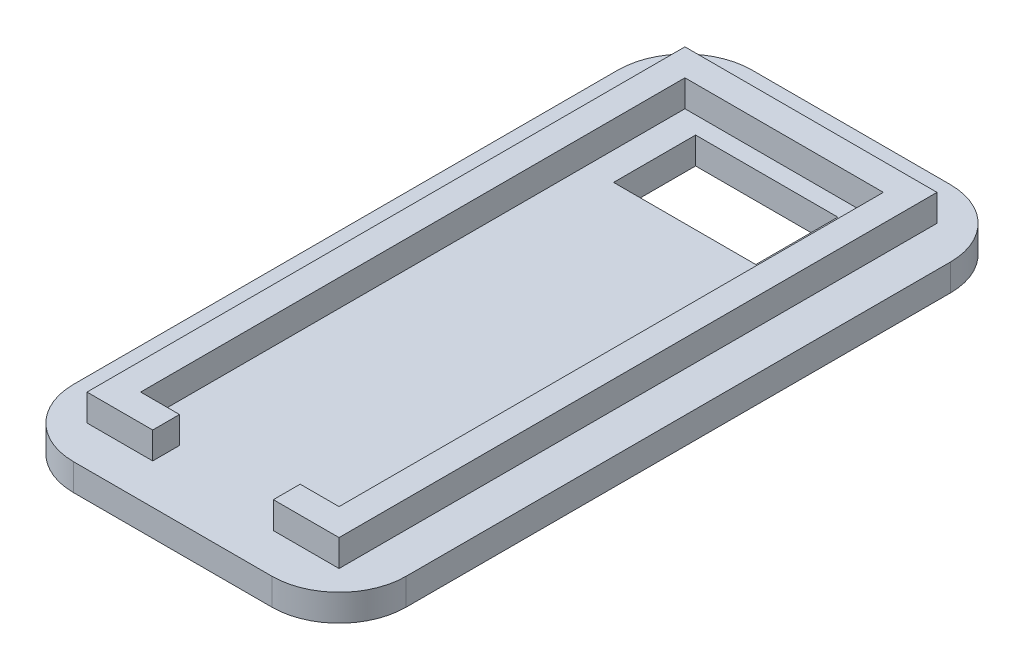
ISO-10303-21;
HEADER;
FILE_DESCRIPTION(('STEP AP214'),'2;1');
FILE_NAME('part.step','',(''),(''),'','','');
FILE_SCHEMA(('AUTOMOTIVE_DESIGN { 1 0 10303 214 1 1 1 1 }'));
ENDSEC;
DATA;
#1=APPLICATION_CONTEXT('core data for automotive mechanical design processes');
#2=APPLICATION_PROTOCOL_DEFINITION('international standard','automotive_design',2000,#1);
#3=PRODUCT_CONTEXT('',#1,'mechanical');
#4=PRODUCT('Part','Part','',(#3));
#5=PRODUCT_RELATED_PRODUCT_CATEGORY('part','',(#4));
#6=PRODUCT_DEFINITION_FORMATION('','',#4);
#7=PRODUCT_DEFINITION_CONTEXT('part definition',#1,'design');
#8=PRODUCT_DEFINITION('design','',#6,#7);
#9=PRODUCT_DEFINITION_SHAPE('','',#8);
#10=(LENGTH_UNIT() NAMED_UNIT(*) SI_UNIT(.MILLI.,.METRE.));
#11=(NAMED_UNIT(*) PLANE_ANGLE_UNIT() SI_UNIT($,.RADIAN.));
#12=(NAMED_UNIT(*) SI_UNIT($,.STERADIAN.) SOLID_ANGLE_UNIT());
#13=UNCERTAINTY_MEASURE_WITH_UNIT(LENGTH_MEASURE(1.E-05),#10,'distance_accuracy_value','');
#14=(GEOMETRIC_REPRESENTATION_CONTEXT(3) GLOBAL_UNCERTAINTY_ASSIGNED_CONTEXT((#13)) GLOBAL_UNIT_ASSIGNED_CONTEXT((#10,
#11,#12)) REPRESENTATION_CONTEXT('',''));
#15=CARTESIAN_POINT('',(0.,0.,0.));
#16=DIRECTION('',(0.,0.,1.));
#17=DIRECTION('',(1.,0.,0.));
#18=AXIS2_PLACEMENT_3D('',#15,#16,#17);
#19=CARTESIAN_POINT('',(0.,2.,0.));
#20=DIRECTION('',(0.,-1.,0.));
#21=DIRECTION('',(0.,0.,-1.));
#22=AXIS2_PLACEMENT_3D('',#19,#20,#21);
#23=PLANE('',#22);
#24=DIRECTION('',(0.,0.,1.));
#25=VECTOR('',#24,1.);
#26=CARTESIAN_POINT('',(-12.4,2.,-25.3));
#27=LINE('',#26,#25);
#28=CARTESIAN_POINT('',(-12.4,2.,-20.3));
#29=VERTEX_POINT('',#28);
#30=CARTESIAN_POINT('',(-12.4,2.,20.3));
#31=VERTEX_POINT('',#30);
#32=EDGE_CURVE('E326',#29,#31,#27,.T.);
#33=ORIENTED_EDGE('',*,*,#32,.T.);
#34=CARTESIAN_POINT('',(-7.4,2.,20.3));
#35=DIRECTION('',(0.,-1.,0.));
#36=DIRECTION('',(0.,0.,-1.));
#37=AXIS2_PLACEMENT_3D('',#34,#35,#36);
#38=CIRCLE('',#37,5.);
#39=CARTESIAN_POINT('',(-7.4,2.,25.3));
#40=VERTEX_POINT('',#39);
#41=EDGE_CURVE('E366',#31,#40,#38,.F.);
#42=ORIENTED_EDGE('',*,*,#41,.T.);
#43=DIRECTION('',(1.,0.,0.));
#44=VECTOR('',#43,1.);
#45=CARTESIAN_POINT('',(-12.4,2.,25.3));
#46=LINE('',#45,#44);
#47=CARTESIAN_POINT('',(7.4,2.,25.3));
#48=VERTEX_POINT('',#47);
#49=EDGE_CURVE('E330',#40,#48,#46,.T.);
#50=ORIENTED_EDGE('',*,*,#49,.T.);
#51=CARTESIAN_POINT('',(7.4,2.,20.3));
#52=DIRECTION('',(0.,-1.,0.));
#53=DIRECTION('',(0.,0.,-1.));
#54=AXIS2_PLACEMENT_3D('',#51,#52,#53);
#55=CIRCLE('',#54,5.);
#56=CARTESIAN_POINT('',(12.4,2.,20.3));
#57=VERTEX_POINT('',#56);
#58=EDGE_CURVE('E56',#48,#57,#55,.F.);
#59=ORIENTED_EDGE('',*,*,#58,.T.);
#60=DIRECTION('',(0.,0.,-1.));
#61=VECTOR('',#60,1.);
#62=CARTESIAN_POINT('',(12.4,2.,-25.3));
#63=LINE('',#62,#61);
#64=CARTESIAN_POINT('',(12.4,2.,-20.3));
#65=VERTEX_POINT('',#64);
#66=EDGE_CURVE('E332',#57,#65,#63,.T.);
#67=ORIENTED_EDGE('',*,*,#66,.T.);
#68=CARTESIAN_POINT('',(7.39999999999999,2.,-20.3));
#69=DIRECTION('',(0.,-1.,0.));
#70=DIRECTION('',(0.,0.,-1.));
#71=AXIS2_PLACEMENT_3D('',#68,#69,#70);
#72=CIRCLE('',#71,5.);
#73=CARTESIAN_POINT('',(7.39999999999999,2.,-25.3));
#74=VERTEX_POINT('',#73);
#75=EDGE_CURVE('E363',#65,#74,#72,.F.);
#76=ORIENTED_EDGE('',*,*,#75,.T.);
#77=DIRECTION('',(-1.,0.,0.));
#78=VECTOR('',#77,1.);
#79=CARTESIAN_POINT('',(-12.4,2.,-25.3));
#80=LINE('',#79,#78);
#81=CARTESIAN_POINT('',(-7.4,2.,-25.3));
#82=VERTEX_POINT('',#81);
#83=EDGE_CURVE('E323',#74,#82,#80,.T.);
#84=ORIENTED_EDGE('',*,*,#83,.T.);
#85=CARTESIAN_POINT('',(-7.4,2.,-20.3));
#86=DIRECTION('',(0.,-1.,0.));
#87=DIRECTION('',(0.,0.,-1.));
#88=AXIS2_PLACEMENT_3D('',#85,#86,#87);
#89=CIRCLE('',#88,5.);
#90=EDGE_CURVE('E361',#82,#29,#89,.F.);
#91=ORIENTED_EDGE('',*,*,#90,.T.);
#92=EDGE_LOOP('',(#33,#42,#50,#59,#67,#76,#84,#91));
#93=FACE_BOUND('',#92,.T.);
#94=DIRECTION('',(0.,0.,1.));
#95=VECTOR('',#94,1.);
#96=CARTESIAN_POINT('',(4.5,2.,0.));
#97=LINE('',#96,#95);
#98=CARTESIAN_POINT('',(4.5,2.,20.3));
#99=VERTEX_POINT('',#98);
#100=CARTESIAN_POINT('',(4.5,2.,22.3));
#101=VERTEX_POINT('',#100);
#102=EDGE_CURVE('E270',#99,#101,#97,.T.);
#103=ORIENTED_EDGE('',*,*,#102,.F.);
#104=DIRECTION('',(1.,0.,0.));
#105=VECTOR('',#104,1.);
#106=CARTESIAN_POINT('',(0.,2.,20.3));
#107=LINE('',#106,#105);
#108=CARTESIAN_POINT('',(7.4,2.,20.3));
#109=VERTEX_POINT('',#108);
#110=EDGE_CURVE('E216',#99,#109,#107,.T.);
#111=ORIENTED_EDGE('',*,*,#110,.T.);
#112=DIRECTION('',(0.,0.,-1.));
#113=VECTOR('',#112,1.);
#114=CARTESIAN_POINT('',(7.4,2.,0.));
#115=LINE('',#114,#113);
#116=CARTESIAN_POINT('',(7.4,2.,-20.3));
#117=VERTEX_POINT('',#116);
#118=EDGE_CURVE('E243',#109,#117,#115,.T.);
#119=ORIENTED_EDGE('',*,*,#118,.T.);
#120=DIRECTION('',(-1.,0.,0.));
#121=VECTOR('',#120,1.);
#122=CARTESIAN_POINT('',(0.,2.,-20.3));
#123=LINE('',#122,#121);
#124=CARTESIAN_POINT('',(-7.39999999999999,2.,-20.3));
#125=VERTEX_POINT('',#124);
#126=EDGE_CURVE('E288',#117,#125,#123,.T.);
#127=ORIENTED_EDGE('',*,*,#126,.T.);
#128=DIRECTION('',(0.,0.,1.));
#129=VECTOR('',#128,1.);
#130=CARTESIAN_POINT('',(-7.39999999999999,2.,0.));
#131=LINE('',#130,#129);
#132=CARTESIAN_POINT('',(-7.39999999999999,2.,20.3));
#133=VERTEX_POINT('',#132);
#134=EDGE_CURVE('E285',#125,#133,#131,.T.);
#135=ORIENTED_EDGE('',*,*,#134,.T.);
#136=CARTESIAN_POINT('',(-4.5,2.,20.3));
#137=VERTEX_POINT('',#136);
#138=EDGE_CURVE('E271',#133,#137,#107,.T.);
#139=ORIENTED_EDGE('',*,*,#138,.T.);
#140=DIRECTION('',(0.,0.,1.));
#141=VECTOR('',#140,1.);
#142=CARTESIAN_POINT('',(-4.5,2.,0.));
#143=LINE('',#142,#141);
#144=CARTESIAN_POINT('',(-4.5,2.,22.3));
#145=VERTEX_POINT('',#144);
#146=EDGE_CURVE('E282',#137,#145,#143,.T.);
#147=ORIENTED_EDGE('',*,*,#146,.T.);
#148=DIRECTION('',(1.,0.,0.));
#149=VECTOR('',#148,1.);
#150=CARTESIAN_POINT('',(0.,2.,22.3));
#151=LINE('',#150,#149);
#152=CARTESIAN_POINT('',(-9.4,2.,22.3));
#153=VERTEX_POINT('',#152);
#154=EDGE_CURVE('E276',#153,#145,#151,.T.);
#155=ORIENTED_EDGE('',*,*,#154,.F.);
#156=DIRECTION('',(0.,0.,1.));
#157=VECTOR('',#156,1.);
#158=CARTESIAN_POINT('',(-9.4,2.,0.));
#159=LINE('',#158,#157);
#160=CARTESIAN_POINT('',(-9.4,2.,-22.3));
#161=VERTEX_POINT('',#160);
#162=EDGE_CURVE('E280',#161,#153,#159,.T.);
#163=ORIENTED_EDGE('',*,*,#162,.F.);
#164=DIRECTION('',(-1.,0.,0.));
#165=VECTOR('',#164,1.);
#166=CARTESIAN_POINT('',(0.,2.,-22.3));
#167=LINE('',#166,#165);
#168=CARTESIAN_POINT('',(9.4,2.,-22.3));
#169=VERTEX_POINT('',#168);
#170=EDGE_CURVE('E278',#169,#161,#167,.T.);
#171=ORIENTED_EDGE('',*,*,#170,.F.);
#172=DIRECTION('',(0.,0.,-1.));
#173=VECTOR('',#172,1.);
#174=CARTESIAN_POINT('',(9.4,2.,0.));
#175=LINE('',#174,#173);
#176=CARTESIAN_POINT('',(9.4,2.,22.3));
#177=VERTEX_POINT('',#176);
#178=EDGE_CURVE('E275',#177,#169,#175,.T.);
#179=ORIENTED_EDGE('',*,*,#178,.F.);
#180=EDGE_CURVE('E273',#101,#177,#151,.T.);
#181=ORIENTED_EDGE('',*,*,#180,.F.);
#182=EDGE_LOOP('',(#103,#111,#119,#127,#135,#139,#147,#155,#163,#171,#179,#181));
#183=FACE_BOUND('',#182,.T.);
#184=DIRECTION('',(1.,0.,0.));
#185=VECTOR('',#184,1.);
#186=CARTESIAN_POINT('',(-5.30499999999999,2.,-19.));
#187=LINE('',#186,#185);
#188=CARTESIAN_POINT('',(-5.30499999999999,2.,-19.));
#189=VERTEX_POINT('',#188);
#190=CARTESIAN_POINT('',(5.30500000000001,2.,-19.));
#191=VERTEX_POINT('',#190);
#192=EDGE_CURVE('E227',#189,#191,#187,.T.);
#193=ORIENTED_EDGE('',*,*,#192,.T.);
#194=DIRECTION('',(0.,0.,1.));
#195=VECTOR('',#194,1.);
#196=CARTESIAN_POINT('',(5.30500000000001,2.,-19.));
#197=LINE('',#196,#195);
#198=CARTESIAN_POINT('',(5.30500000000001,2.,-12.88));
#199=VERTEX_POINT('',#198);
#200=EDGE_CURVE('E215',#191,#199,#197,.T.);
#201=ORIENTED_EDGE('',*,*,#200,.T.);
#202=DIRECTION('',(1.,0.,0.));
#203=VECTOR('',#202,1.);
#204=CARTESIAN_POINT('',(-5.30499999999999,2.,-12.88));
#205=LINE('',#204,#203);
#206=CARTESIAN_POINT('',(-5.30499999999999,2.,-12.88));
#207=VERTEX_POINT('',#206);
#208=EDGE_CURVE('E230',#207,#199,#205,.T.);
#209=ORIENTED_EDGE('',*,*,#208,.F.);
#210=DIRECTION('',(0.,0.,1.));
#211=VECTOR('',#210,1.);
#212=CARTESIAN_POINT('',(-5.30499999999999,2.,-19.));
#213=LINE('',#212,#211);
#214=EDGE_CURVE('E209',#189,#207,#213,.T.);
#215=ORIENTED_EDGE('',*,*,#214,.F.);
#216=EDGE_LOOP('',(#193,#201,#209,#215));
#217=FACE_BOUND('',#216,.T.);
#218=ADVANCED_FACE('F34',(#93,#183,#217),#23,.F.);
#219=CARTESIAN_POINT('',(0.,0.,0.));
#220=DIRECTION('',(0.,-1.,0.));
#221=DIRECTION('',(0.,0.,-1.));
#222=AXIS2_PLACEMENT_3D('',#219,#220,#221);
#223=PLANE('',#222);
#224=DIRECTION('',(1.,0.,0.));
#225=VECTOR('',#224,1.);
#226=CARTESIAN_POINT('',(-12.4,0.,25.3));
#227=LINE('',#226,#225);
#228=CARTESIAN_POINT('',(-7.4,0.,25.3));
#229=VERTEX_POINT('',#228);
#230=CARTESIAN_POINT('',(7.4,0.,25.3));
#231=VERTEX_POINT('',#230);
#232=EDGE_CURVE('E340',#229,#231,#227,.T.);
#233=ORIENTED_EDGE('',*,*,#232,.F.);
#234=CARTESIAN_POINT('',(-7.4,0.,20.3));
#235=DIRECTION('',(0.,-1.,0.));
#236=DIRECTION('',(0.,0.,-1.));
#237=AXIS2_PLACEMENT_3D('',#234,#235,#236);
#238=CIRCLE('',#237,5.);
#239=CARTESIAN_POINT('',(-12.4,0.,20.3));
#240=VERTEX_POINT('',#239);
#241=EDGE_CURVE('E354',#229,#240,#238,.T.);
#242=ORIENTED_EDGE('',*,*,#241,.T.);
#243=DIRECTION('',(0.,0.,1.));
#244=VECTOR('',#243,1.);
#245=CARTESIAN_POINT('',(-12.4,0.,-25.3));
#246=LINE('',#245,#244);
#247=CARTESIAN_POINT('',(-12.4,0.,-20.3));
#248=VERTEX_POINT('',#247);
#249=EDGE_CURVE('E337',#248,#240,#246,.T.);
#250=ORIENTED_EDGE('',*,*,#249,.F.);
#251=CARTESIAN_POINT('',(-7.4,0.,-20.3));
#252=DIRECTION('',(0.,-1.,0.));
#253=DIRECTION('',(0.,0.,-1.));
#254=AXIS2_PLACEMENT_3D('',#251,#252,#253);
#255=CIRCLE('',#254,5.);
#256=CARTESIAN_POINT('',(-7.4,0.,-25.3));
#257=VERTEX_POINT('',#256);
#258=EDGE_CURVE('E348',#248,#257,#255,.T.);
#259=ORIENTED_EDGE('',*,*,#258,.T.);
#260=DIRECTION('',(-1.,0.,0.));
#261=VECTOR('',#260,1.);
#262=CARTESIAN_POINT('',(-12.4,0.,-25.3));
#263=LINE('',#262,#261);
#264=CARTESIAN_POINT('',(7.39999999999999,0.,-25.3));
#265=VERTEX_POINT('',#264);
#266=EDGE_CURVE('E322',#265,#257,#263,.T.);
#267=ORIENTED_EDGE('',*,*,#266,.F.);
#268=CARTESIAN_POINT('',(7.39999999999999,0.,-20.3));
#269=DIRECTION('',(0.,-1.,0.));
#270=DIRECTION('',(0.,0.,-1.));
#271=AXIS2_PLACEMENT_3D('',#268,#269,#270);
#272=CIRCLE('',#271,5.);
#273=CARTESIAN_POINT('',(12.4,0.,-20.3));
#274=VERTEX_POINT('',#273);
#275=EDGE_CURVE('E350',#265,#274,#272,.T.);
#276=ORIENTED_EDGE('',*,*,#275,.T.);
#277=DIRECTION('',(0.,0.,-1.));
#278=VECTOR('',#277,1.);
#279=CARTESIAN_POINT('',(12.4,0.,-25.3));
#280=LINE('',#279,#278);
#281=CARTESIAN_POINT('',(12.4,0.,20.3));
#282=VERTEX_POINT('',#281);
#283=EDGE_CURVE('E327',#282,#274,#280,.T.);
#284=ORIENTED_EDGE('',*,*,#283,.F.);
#285=CARTESIAN_POINT('',(7.4,0.,20.3));
#286=DIRECTION('',(0.,-1.,0.));
#287=DIRECTION('',(0.,0.,-1.));
#288=AXIS2_PLACEMENT_3D('',#285,#286,#287);
#289=CIRCLE('',#288,5.);
#290=EDGE_CURVE('E352',#282,#231,#289,.T.);
#291=ORIENTED_EDGE('',*,*,#290,.T.);
#292=EDGE_LOOP('',(#233,#242,#250,#259,#267,#276,#284,#291));
#293=FACE_BOUND('',#292,.T.);
#294=DIRECTION('',(0.,0.,1.));
#295=VECTOR('',#294,1.);
#296=CARTESIAN_POINT('',(5.30500000000001,0.,-19.));
#297=LINE('',#296,#295);
#298=CARTESIAN_POINT('',(5.30500000000001,0.,-19.));
#299=VERTEX_POINT('',#298);
#300=CARTESIAN_POINT('',(5.30500000000001,0.,-12.88));
#301=VERTEX_POINT('',#300);
#302=EDGE_CURVE('E208',#299,#301,#297,.T.);
#303=ORIENTED_EDGE('',*,*,#302,.F.);
#304=DIRECTION('',(1.,0.,0.));
#305=VECTOR('',#304,1.);
#306=CARTESIAN_POINT('',(-5.30499999999999,0.,-19.));
#307=LINE('',#306,#305);
#308=CARTESIAN_POINT('',(-5.30499999999999,0.,-19.));
#309=VERTEX_POINT('',#308);
#310=EDGE_CURVE('E197',#309,#299,#307,.T.);
#311=ORIENTED_EDGE('',*,*,#310,.F.);
#312=DIRECTION('',(0.,0.,1.));
#313=VECTOR('',#312,1.);
#314=CARTESIAN_POINT('',(-5.30499999999999,0.,-19.));
#315=LINE('',#314,#313);
#316=CARTESIAN_POINT('',(-5.30499999999999,0.,-12.88));
#317=VERTEX_POINT('',#316);
#318=EDGE_CURVE('E223',#309,#317,#315,.T.);
#319=ORIENTED_EDGE('',*,*,#318,.T.);
#320=DIRECTION('',(1.,0.,0.));
#321=VECTOR('',#320,1.);
#322=CARTESIAN_POINT('',(-5.30499999999999,0.,-12.88));
#323=LINE('',#322,#321);
#324=EDGE_CURVE('E221',#317,#301,#323,.T.);
#325=ORIENTED_EDGE('',*,*,#324,.T.);
#326=EDGE_LOOP('',(#303,#311,#319,#325));
#327=FACE_BOUND('',#326,.T.);
#328=ADVANCED_FACE('F220',(#293,#327),#223,.T.);
#329=CARTESIAN_POINT('',(-12.4,2.,-25.3));
#330=DIRECTION('',(0.,0.,1.));
#331=DIRECTION('',(1.,0.,0.));
#332=AXIS2_PLACEMENT_3D('',#329,#330,#331);
#333=PLANE('',#332);
#334=ORIENTED_EDGE('',*,*,#83,.F.);
#335=DIRECTION('',(0.,-1.,0.));
#336=VECTOR('',#335,1.);
#337=CARTESIAN_POINT('',(7.39999999999999,2.,-25.3));
#338=LINE('',#337,#336);
#339=EDGE_CURVE('E11',#74,#265,#338,.T.);
#340=ORIENTED_EDGE('',*,*,#339,.T.);
#341=ORIENTED_EDGE('',*,*,#266,.T.);
#342=DIRECTION('',(0.,-1.,0.));
#343=VECTOR('',#342,1.);
#344=CARTESIAN_POINT('',(-7.4,2.,-25.3));
#345=LINE('',#344,#343);
#346=EDGE_CURVE('E42',#257,#82,#345,.F.);
#347=ORIENTED_EDGE('',*,*,#346,.T.);
#348=EDGE_LOOP('',(#334,#340,#341,#347));
#349=FACE_BOUND('',#348,.T.);
#350=ADVANCED_FACE('F374',(#349),#333,.F.);
#351=CARTESIAN_POINT('',(-12.4,2.,-25.3));
#352=DIRECTION('',(1.,0.,0.));
#353=DIRECTION('',(0.,0.,-1.));
#354=AXIS2_PLACEMENT_3D('',#351,#352,#353);
#355=PLANE('',#354);
#356=ORIENTED_EDGE('',*,*,#249,.T.);
#357=DIRECTION('',(0.,-1.,0.));
#358=VECTOR('',#357,1.);
#359=CARTESIAN_POINT('',(-12.4,2.,20.3));
#360=LINE('',#359,#358);
#361=EDGE_CURVE('E359',#240,#31,#360,.F.);
#362=ORIENTED_EDGE('',*,*,#361,.T.);
#363=ORIENTED_EDGE('',*,*,#32,.F.);
#364=DIRECTION('',(0.,-1.,0.));
#365=VECTOR('',#364,1.);
#366=CARTESIAN_POINT('',(-12.4,2.,-20.3));
#367=LINE('',#366,#365);
#368=EDGE_CURVE('E356',#29,#248,#367,.T.);
#369=ORIENTED_EDGE('',*,*,#368,.T.);
#370=EDGE_LOOP('',(#356,#362,#363,#369));
#371=FACE_BOUND('',#370,.T.);
#372=ADVANCED_FACE('F385',(#371),#355,.F.);
#373=CARTESIAN_POINT('',(-12.4,2.,25.3));
#374=DIRECTION('',(0.,0.,-1.));
#375=DIRECTION('',(-1.,0.,0.));
#376=AXIS2_PLACEMENT_3D('',#373,#374,#375);
#377=PLANE('',#376);
#378=ORIENTED_EDGE('',*,*,#49,.F.);
#379=DIRECTION('',(0.,-1.,0.));
#380=VECTOR('',#379,1.);
#381=CARTESIAN_POINT('',(-7.4,2.,25.3));
#382=LINE('',#381,#380);
#383=EDGE_CURVE('E345',#40,#229,#382,.T.);
#384=ORIENTED_EDGE('',*,*,#383,.T.);
#385=ORIENTED_EDGE('',*,*,#232,.T.);
#386=DIRECTION('',(0.,-1.,0.));
#387=VECTOR('',#386,1.);
#388=CARTESIAN_POINT('',(7.4,2.,25.3));
#389=LINE('',#388,#387);
#390=EDGE_CURVE('E334',#231,#48,#389,.F.);
#391=ORIENTED_EDGE('',*,*,#390,.T.);
#392=EDGE_LOOP('',(#378,#384,#385,#391));
#393=FACE_BOUND('',#392,.T.);
#394=ADVANCED_FACE('F395',(#393),#377,.F.);
#395=CARTESIAN_POINT('',(12.4,2.,-25.3));
#396=DIRECTION('',(-1.,0.,0.));
#397=DIRECTION('',(0.,0.,1.));
#398=AXIS2_PLACEMENT_3D('',#395,#396,#397);
#399=PLANE('',#398);
#400=ORIENTED_EDGE('',*,*,#66,.F.);
#401=DIRECTION('',(0.,-1.,0.));
#402=VECTOR('',#401,1.);
#403=CARTESIAN_POINT('',(12.4,2.,20.3));
#404=LINE('',#403,#402);
#405=EDGE_CURVE('E369',#57,#282,#404,.T.);
#406=ORIENTED_EDGE('',*,*,#405,.T.);
#407=ORIENTED_EDGE('',*,*,#283,.T.);
#408=DIRECTION('',(0.,-1.,0.));
#409=VECTOR('',#408,1.);
#410=CARTESIAN_POINT('',(12.4,2.,-20.3));
#411=LINE('',#410,#409);
#412=EDGE_CURVE('E49',#274,#65,#411,.F.);
#413=ORIENTED_EDGE('',*,*,#412,.T.);
#414=EDGE_LOOP('',(#400,#406,#407,#413));
#415=FACE_BOUND('',#414,.T.);
#416=ADVANCED_FACE('F401',(#415),#399,.F.);
#417=CARTESIAN_POINT('',(0.,4.,20.3));
#418=DIRECTION('',(0.,0.,-1.));
#419=DIRECTION('',(-1.,0.,0.));
#420=AXIS2_PLACEMENT_3D('',#417,#418,#419);
#421=PLANE('',#420);
#422=ORIENTED_EDGE('',*,*,#110,.F.);
#423=DIRECTION('',(0.,-1.,0.));
#424=VECTOR('',#423,1.);
#425=CARTESIAN_POINT('',(4.5,4.,20.3));
#426=LINE('',#425,#424);
#427=CARTESIAN_POINT('',(4.5,4.,20.3));
#428=VERTEX_POINT('',#427);
#429=EDGE_CURVE('E320',#428,#99,#426,.T.);
#430=ORIENTED_EDGE('',*,*,#429,.F.);
#431=DIRECTION('',(1.,0.,0.));
#432=VECTOR('',#431,1.);
#433=CARTESIAN_POINT('',(0.,4.,20.3));
#434=LINE('',#433,#432);
#435=CARTESIAN_POINT('',(7.4,4.,20.3));
#436=VERTEX_POINT('',#435);
#437=EDGE_CURVE('E239',#428,#436,#434,.T.);
#438=ORIENTED_EDGE('',*,*,#437,.T.);
#439=DIRECTION('',(0.,-1.,0.));
#440=VECTOR('',#439,1.);
#441=CARTESIAN_POINT('',(7.4,4.,20.3));
#442=LINE('',#441,#440);
#443=EDGE_CURVE('E267',#436,#109,#442,.T.);
#444=ORIENTED_EDGE('',*,*,#443,.T.);
#445=EDGE_LOOP('',(#422,#430,#438,#444));
#446=FACE_BOUND('',#445,.T.);
#447=ADVANCED_FACE('F422',(#446),#421,.T.);
#448=CARTESIAN_POINT('',(4.5,4.,0.));
#449=DIRECTION('',(1.,0.,0.));
#450=DIRECTION('',(0.,0.,-1.));
#451=AXIS2_PLACEMENT_3D('',#448,#449,#450);
#452=PLANE('',#451);
#453=ORIENTED_EDGE('',*,*,#102,.T.);
#454=DIRECTION('',(0.,-1.,0.));
#455=VECTOR('',#454,1.);
#456=CARTESIAN_POINT('',(4.5,4.,22.3));
#457=LINE('',#456,#455);
#458=CARTESIAN_POINT('',(4.5,4.,22.3));
#459=VERTEX_POINT('',#458);
#460=EDGE_CURVE('E317',#459,#101,#457,.T.);
#461=ORIENTED_EDGE('',*,*,#460,.F.);
#462=DIRECTION('',(0.,0.,1.));
#463=VECTOR('',#462,1.);
#464=CARTESIAN_POINT('',(4.5,4.,0.));
#465=LINE('',#464,#463);
#466=EDGE_CURVE('E242',#428,#459,#465,.T.);
#467=ORIENTED_EDGE('',*,*,#466,.F.);
#468=ORIENTED_EDGE('',*,*,#429,.T.);
#469=EDGE_LOOP('',(#453,#461,#467,#468));
#470=FACE_BOUND('',#469,.T.);
#471=ADVANCED_FACE('F417',(#470),#452,.F.);
#472=CARTESIAN_POINT('',(0.,4.,22.3));
#473=DIRECTION('',(0.,0.,-1.));
#474=DIRECTION('',(-1.,0.,0.));
#475=AXIS2_PLACEMENT_3D('',#472,#473,#474);
#476=PLANE('',#475);
#477=ORIENTED_EDGE('',*,*,#180,.T.);
#478=DIRECTION('',(0.,-1.,0.));
#479=VECTOR('',#478,1.);
#480=CARTESIAN_POINT('',(9.4,4.,22.3));
#481=LINE('',#480,#479);
#482=CARTESIAN_POINT('',(9.4,4.,22.3));
#483=VERTEX_POINT('',#482);
#484=EDGE_CURVE('E314',#483,#177,#481,.T.);
#485=ORIENTED_EDGE('',*,*,#484,.F.);
#486=DIRECTION('',(1.,0.,0.));
#487=VECTOR('',#486,1.);
#488=CARTESIAN_POINT('',(0.,4.,22.3));
#489=LINE('',#488,#487);
#490=EDGE_CURVE('E246',#459,#483,#489,.T.);
#491=ORIENTED_EDGE('',*,*,#490,.F.);
#492=ORIENTED_EDGE('',*,*,#460,.T.);
#493=EDGE_LOOP('',(#477,#485,#491,#492));
#494=FACE_BOUND('',#493,.T.);
#495=ADVANCED_FACE('F476',(#494),#476,.F.);
#496=CARTESIAN_POINT('',(9.4,4.,0.));
#497=DIRECTION('',(-1.,0.,0.));
#498=DIRECTION('',(0.,0.,1.));
#499=AXIS2_PLACEMENT_3D('',#496,#497,#498);
#500=PLANE('',#499);
#501=ORIENTED_EDGE('',*,*,#178,.T.);
#502=DIRECTION('',(0.,-1.,0.));
#503=VECTOR('',#502,1.);
#504=CARTESIAN_POINT('',(9.4,4.,-22.3));
#505=LINE('',#504,#503);
#506=CARTESIAN_POINT('',(9.4,4.,-22.3));
#507=VERTEX_POINT('',#506);
#508=EDGE_CURVE('E311',#507,#169,#505,.T.);
#509=ORIENTED_EDGE('',*,*,#508,.F.);
#510=DIRECTION('',(0.,0.,-1.));
#511=VECTOR('',#510,1.);
#512=CARTESIAN_POINT('',(9.4,4.,0.));
#513=LINE('',#512,#511);
#514=EDGE_CURVE('E248',#483,#507,#513,.T.);
#515=ORIENTED_EDGE('',*,*,#514,.F.);
#516=ORIENTED_EDGE('',*,*,#484,.T.);
#517=EDGE_LOOP('',(#501,#509,#515,#516));
#518=FACE_BOUND('',#517,.T.);
#519=ADVANCED_FACE('F482',(#518),#500,.F.);
#520=CARTESIAN_POINT('',(0.,4.,-22.3));
#521=DIRECTION('',(0.,0.,1.));
#522=DIRECTION('',(1.,0.,0.));
#523=AXIS2_PLACEMENT_3D('',#520,#521,#522);
#524=PLANE('',#523);
#525=ORIENTED_EDGE('',*,*,#170,.T.);
#526=DIRECTION('',(0.,-1.,0.));
#527=VECTOR('',#526,1.);
#528=CARTESIAN_POINT('',(-9.4,4.,-22.3));
#529=LINE('',#528,#527);
#530=CARTESIAN_POINT('',(-9.4,4.,-22.3));
#531=VERTEX_POINT('',#530);
#532=EDGE_CURVE('E308',#531,#161,#529,.T.);
#533=ORIENTED_EDGE('',*,*,#532,.F.);
#534=DIRECTION('',(-1.,0.,0.));
#535=VECTOR('',#534,1.);
#536=CARTESIAN_POINT('',(0.,4.,-22.3));
#537=LINE('',#536,#535);
#538=EDGE_CURVE('E251',#507,#531,#537,.T.);
#539=ORIENTED_EDGE('',*,*,#538,.F.);
#540=ORIENTED_EDGE('',*,*,#508,.T.);
#541=EDGE_LOOP('',(#525,#533,#539,#540));
#542=FACE_BOUND('',#541,.T.);
#543=ADVANCED_FACE('F479',(#542),#524,.F.);
#544=CARTESIAN_POINT('',(-9.4,4.,0.));
#545=DIRECTION('',(1.,0.,0.));
#546=DIRECTION('',(0.,0.,-1.));
#547=AXIS2_PLACEMENT_3D('',#544,#545,#546);
#548=PLANE('',#547);
#549=ORIENTED_EDGE('',*,*,#162,.T.);
#550=DIRECTION('',(0.,-1.,0.));
#551=VECTOR('',#550,1.);
#552=CARTESIAN_POINT('',(-9.4,4.,22.3));
#553=LINE('',#552,#551);
#554=CARTESIAN_POINT('',(-9.4,4.,22.3));
#555=VERTEX_POINT('',#554);
#556=EDGE_CURVE('E305',#555,#153,#553,.T.);
#557=ORIENTED_EDGE('',*,*,#556,.F.);
#558=DIRECTION('',(0.,0.,1.));
#559=VECTOR('',#558,1.);
#560=CARTESIAN_POINT('',(-9.4,4.,0.));
#561=LINE('',#560,#559);
#562=EDGE_CURVE('E253',#531,#555,#561,.T.);
#563=ORIENTED_EDGE('',*,*,#562,.F.);
#564=ORIENTED_EDGE('',*,*,#532,.T.);
#565=EDGE_LOOP('',(#549,#557,#563,#564));
#566=FACE_BOUND('',#565,.T.);
#567=ADVANCED_FACE('F474',(#566),#548,.F.);
#568=ORIENTED_EDGE('',*,*,#154,.T.);
#569=DIRECTION('',(0.,-1.,0.));
#570=VECTOR('',#569,1.);
#571=CARTESIAN_POINT('',(-4.5,4.,22.3));
#572=LINE('',#571,#570);
#573=CARTESIAN_POINT('',(-4.5,4.,22.3));
#574=VERTEX_POINT('',#573);
#575=EDGE_CURVE('E303',#574,#145,#572,.T.);
#576=ORIENTED_EDGE('',*,*,#575,.F.);
#577=EDGE_CURVE('E249',#555,#574,#489,.T.);
#578=ORIENTED_EDGE('',*,*,#577,.F.);
#579=ORIENTED_EDGE('',*,*,#556,.T.);
#580=EDGE_LOOP('',(#568,#576,#578,#579));
#581=FACE_BOUND('',#580,.T.);
#582=ADVANCED_FACE('F470',(#581),#476,.F.);
#583=CARTESIAN_POINT('',(-4.5,4.,0.));
#584=DIRECTION('',(1.,0.,0.));
#585=DIRECTION('',(0.,0.,-1.));
#586=AXIS2_PLACEMENT_3D('',#583,#584,#585);
#587=PLANE('',#586);
#588=ORIENTED_EDGE('',*,*,#146,.F.);
#589=DIRECTION('',(0.,-1.,0.));
#590=VECTOR('',#589,1.);
#591=CARTESIAN_POINT('',(-4.5,4.,20.3));
#592=LINE('',#591,#590);
#593=CARTESIAN_POINT('',(-4.5,4.,20.3));
#594=VERTEX_POINT('',#593);
#595=EDGE_CURVE('E301',#594,#137,#592,.T.);
#596=ORIENTED_EDGE('',*,*,#595,.F.);
#597=DIRECTION('',(0.,0.,1.));
#598=VECTOR('',#597,1.);
#599=CARTESIAN_POINT('',(-4.5,4.,0.));
#600=LINE('',#599,#598);
#601=EDGE_CURVE('E255',#594,#574,#600,.T.);
#602=ORIENTED_EDGE('',*,*,#601,.T.);
#603=ORIENTED_EDGE('',*,*,#575,.T.);
#604=EDGE_LOOP('',(#588,#596,#602,#603));
#605=FACE_BOUND('',#604,.T.);
#606=ADVANCED_FACE('F466',(#605),#587,.T.);
#607=ORIENTED_EDGE('',*,*,#138,.F.);
#608=DIRECTION('',(0.,-1.,0.));
#609=VECTOR('',#608,1.);
#610=CARTESIAN_POINT('',(-7.39999999999999,4.,20.3));
#611=LINE('',#610,#609);
#612=CARTESIAN_POINT('',(-7.39999999999999,4.,20.3));
#613=VERTEX_POINT('',#612);
#614=EDGE_CURVE('E299',#613,#133,#611,.T.);
#615=ORIENTED_EDGE('',*,*,#614,.F.);
#616=EDGE_CURVE('E244',#613,#594,#434,.T.);
#617=ORIENTED_EDGE('',*,*,#616,.T.);
#618=ORIENTED_EDGE('',*,*,#595,.T.);
#619=EDGE_LOOP('',(#607,#615,#617,#618));
#620=FACE_BOUND('',#619,.T.);
#621=ADVANCED_FACE('F462',(#620),#421,.T.);
#622=CARTESIAN_POINT('',(-7.39999999999999,4.,0.));
#623=DIRECTION('',(1.,0.,0.));
#624=DIRECTION('',(0.,0.,-1.));
#625=AXIS2_PLACEMENT_3D('',#622,#623,#624);
#626=PLANE('',#625);
#627=ORIENTED_EDGE('',*,*,#134,.F.);
#628=DIRECTION('',(0.,-1.,0.));
#629=VECTOR('',#628,1.);
#630=CARTESIAN_POINT('',(-7.39999999999999,4.,-20.3));
#631=LINE('',#630,#629);
#632=CARTESIAN_POINT('',(-7.39999999999999,4.,-20.3));
#633=VERTEX_POINT('',#632);
#634=EDGE_CURVE('E297',#633,#125,#631,.T.);
#635=ORIENTED_EDGE('',*,*,#634,.F.);
#636=DIRECTION('',(0.,0.,1.));
#637=VECTOR('',#636,1.);
#638=CARTESIAN_POINT('',(-7.39999999999999,4.,0.));
#639=LINE('',#638,#637);
#640=EDGE_CURVE('E258',#633,#613,#639,.T.);
#641=ORIENTED_EDGE('',*,*,#640,.T.);
#642=ORIENTED_EDGE('',*,*,#614,.T.);
#643=EDGE_LOOP('',(#627,#635,#641,#642));
#644=FACE_BOUND('',#643,.T.);
#645=ADVANCED_FACE('F458',(#644),#626,.T.);
#646=CARTESIAN_POINT('',(0.,4.,-20.3));
#647=DIRECTION('',(0.,0.,1.));
#648=DIRECTION('',(1.,0.,0.));
#649=AXIS2_PLACEMENT_3D('',#646,#647,#648);
#650=PLANE('',#649);
#651=ORIENTED_EDGE('',*,*,#126,.F.);
#652=DIRECTION('',(0.,-1.,0.));
#653=VECTOR('',#652,1.);
#654=CARTESIAN_POINT('',(7.4,4.,-20.3));
#655=LINE('',#654,#653);
#656=CARTESIAN_POINT('',(7.4,4.,-20.3));
#657=VERTEX_POINT('',#656);
#658=EDGE_CURVE('E294',#657,#117,#655,.T.);
#659=ORIENTED_EDGE('',*,*,#658,.F.);
#660=DIRECTION('',(-1.,0.,0.));
#661=VECTOR('',#660,1.);
#662=CARTESIAN_POINT('',(0.,4.,-20.3));
#663=LINE('',#662,#661);
#664=EDGE_CURVE('E261',#657,#633,#663,.T.);
#665=ORIENTED_EDGE('',*,*,#664,.T.);
#666=ORIENTED_EDGE('',*,*,#634,.T.);
#667=EDGE_LOOP('',(#651,#659,#665,#666));
#668=FACE_BOUND('',#667,.T.);
#669=ADVANCED_FACE('F454',(#668),#650,.T.);
#670=CARTESIAN_POINT('',(7.4,4.,0.));
#671=DIRECTION('',(-1.,0.,0.));
#672=DIRECTION('',(0.,0.,1.));
#673=AXIS2_PLACEMENT_3D('',#670,#671,#672);
#674=PLANE('',#673);
#675=ORIENTED_EDGE('',*,*,#118,.F.);
#676=ORIENTED_EDGE('',*,*,#443,.F.);
#677=DIRECTION('',(0.,0.,-1.));
#678=VECTOR('',#677,1.);
#679=CARTESIAN_POINT('',(7.4,4.,0.));
#680=LINE('',#679,#678);
#681=EDGE_CURVE('E264',#436,#657,#680,.T.);
#682=ORIENTED_EDGE('',*,*,#681,.T.);
#683=ORIENTED_EDGE('',*,*,#658,.T.);
#684=EDGE_LOOP('',(#675,#676,#682,#683));
#685=FACE_BOUND('',#684,.T.);
#686=ADVANCED_FACE('F450',(#685),#674,.T.);
#687=CARTESIAN_POINT('',(0.,4.,0.));
#688=DIRECTION('',(0.,1.,0.));
#689=DIRECTION('',(0.,0.,1.));
#690=AXIS2_PLACEMENT_3D('',#687,#688,#689);
#691=PLANE('',#690);
#692=ORIENTED_EDGE('',*,*,#437,.F.);
#693=ORIENTED_EDGE('',*,*,#466,.T.);
#694=ORIENTED_EDGE('',*,*,#490,.T.);
#695=ORIENTED_EDGE('',*,*,#514,.T.);
#696=ORIENTED_EDGE('',*,*,#538,.T.);
#697=ORIENTED_EDGE('',*,*,#562,.T.);
#698=ORIENTED_EDGE('',*,*,#577,.T.);
#699=ORIENTED_EDGE('',*,*,#601,.F.);
#700=ORIENTED_EDGE('',*,*,#616,.F.);
#701=ORIENTED_EDGE('',*,*,#640,.F.);
#702=ORIENTED_EDGE('',*,*,#664,.F.);
#703=ORIENTED_EDGE('',*,*,#681,.F.);
#704=EDGE_LOOP('',(#692,#693,#694,#695,#696,#697,#698,#699,#700,#701,#702,#703));
#705=FACE_BOUND('',#704,.T.);
#706=ADVANCED_FACE('F447',(#705),#691,.T.);
#707=CARTESIAN_POINT('',(-5.30499999999999,0.,-19.));
#708=DIRECTION('',(0.,0.,1.));
#709=DIRECTION('',(1.,0.,0.));
#710=AXIS2_PLACEMENT_3D('',#707,#708,#709);
#711=PLANE('',#710);
#712=ORIENTED_EDGE('',*,*,#192,.F.);
#713=DIRECTION('',(0.,1.,0.));
#714=VECTOR('',#713,1.);
#715=CARTESIAN_POINT('',(-5.30499999999999,0.,-19.));
#716=LINE('',#715,#714);
#717=EDGE_CURVE('E203',#309,#189,#716,.T.);
#718=ORIENTED_EDGE('',*,*,#717,.F.);
#719=ORIENTED_EDGE('',*,*,#310,.T.);
#720=DIRECTION('',(0.,1.,0.));
#721=VECTOR('',#720,1.);
#722=CARTESIAN_POINT('',(5.30500000000001,0.,-19.));
#723=LINE('',#722,#721);
#724=EDGE_CURVE('E200',#299,#191,#723,.T.);
#725=ORIENTED_EDGE('',*,*,#724,.T.);
#726=EDGE_LOOP('',(#712,#718,#719,#725));
#727=FACE_BOUND('',#726,.T.);
#728=ADVANCED_FACE('F199',(#727),#711,.T.);
#729=CARTESIAN_POINT('',(5.30500000000001,0.,-19.));
#730=DIRECTION('',(-1.,0.,0.));
#731=DIRECTION('',(0.,0.,1.));
#732=AXIS2_PLACEMENT_3D('',#729,#730,#731);
#733=PLANE('',#732);
#734=ORIENTED_EDGE('',*,*,#200,.F.);
#735=ORIENTED_EDGE('',*,*,#724,.F.);
#736=ORIENTED_EDGE('',*,*,#302,.T.);
#737=DIRECTION('',(0.,1.,0.));
#738=VECTOR('',#737,1.);
#739=CARTESIAN_POINT('',(5.30500000000001,0.,-12.88));
#740=LINE('',#739,#738);
#741=EDGE_CURVE('E217',#301,#199,#740,.T.);
#742=ORIENTED_EDGE('',*,*,#741,.T.);
#743=EDGE_LOOP('',(#734,#735,#736,#742));
#744=FACE_BOUND('',#743,.T.);
#745=ADVANCED_FACE('F212',(#744),#733,.T.);
#746=CARTESIAN_POINT('',(-5.30499999999999,0.,-12.88));
#747=DIRECTION('',(0.,0.,1.));
#748=DIRECTION('',(1.,0.,0.));
#749=AXIS2_PLACEMENT_3D('',#746,#747,#748);
#750=PLANE('',#749);
#751=ORIENTED_EDGE('',*,*,#208,.T.);
#752=ORIENTED_EDGE('',*,*,#741,.F.);
#753=ORIENTED_EDGE('',*,*,#324,.F.);
#754=DIRECTION('',(0.,1.,0.));
#755=VECTOR('',#754,1.);
#756=CARTESIAN_POINT('',(-5.30499999999999,0.,-12.88));
#757=LINE('',#756,#755);
#758=EDGE_CURVE('E236',#317,#207,#757,.T.);
#759=ORIENTED_EDGE('',*,*,#758,.T.);
#760=EDGE_LOOP('',(#751,#752,#753,#759));
#761=FACE_BOUND('',#760,.T.);
#762=ADVANCED_FACE('F434',(#761),#750,.F.);
#763=CARTESIAN_POINT('',(-5.30499999999999,0.,-19.));
#764=DIRECTION('',(-1.,0.,0.));
#765=DIRECTION('',(0.,0.,1.));
#766=AXIS2_PLACEMENT_3D('',#763,#764,#765);
#767=PLANE('',#766);
#768=ORIENTED_EDGE('',*,*,#214,.T.);
#769=ORIENTED_EDGE('',*,*,#758,.F.);
#770=ORIENTED_EDGE('',*,*,#318,.F.);
#771=ORIENTED_EDGE('',*,*,#717,.T.);
#772=EDGE_LOOP('',(#768,#769,#770,#771));
#773=FACE_BOUND('',#772,.T.);
#774=ADVANCED_FACE('F430',(#773),#767,.F.);
#775=CARTESIAN_POINT('',(-7.4,2.,20.3));
#776=DIRECTION('',(0.,-1.,0.));
#777=DIRECTION('',(0.,0.,-1.));
#778=AXIS2_PLACEMENT_3D('',#775,#776,#777);
#779=CYLINDRICAL_SURFACE('',#778,5.);
#780=ORIENTED_EDGE('',*,*,#41,.F.);
#781=ORIENTED_EDGE('',*,*,#361,.F.);
#782=ORIENTED_EDGE('',*,*,#241,.F.);
#783=ORIENTED_EDGE('',*,*,#383,.F.);
#784=EDGE_LOOP('',(#780,#781,#782,#783));
#785=FACE_BOUND('',#784,.T.);
#786=ADVANCED_FACE('F392',(#785),#779,.T.);
#787=CARTESIAN_POINT('',(7.4,2.,20.3));
#788=DIRECTION('',(0.,-1.,0.));
#789=DIRECTION('',(0.,0.,-1.));
#790=AXIS2_PLACEMENT_3D('',#787,#788,#789);
#791=CYLINDRICAL_SURFACE('',#790,5.);
#792=ORIENTED_EDGE('',*,*,#58,.F.);
#793=ORIENTED_EDGE('',*,*,#390,.F.);
#794=ORIENTED_EDGE('',*,*,#290,.F.);
#795=ORIENTED_EDGE('',*,*,#405,.F.);
#796=EDGE_LOOP('',(#792,#793,#794,#795));
#797=FACE_BOUND('',#796,.T.);
#798=ADVANCED_FACE('F399',(#797),#791,.T.);
#799=CARTESIAN_POINT('',(7.39999999999999,2.,-20.3));
#800=DIRECTION('',(0.,-1.,0.));
#801=DIRECTION('',(0.,0.,-1.));
#802=AXIS2_PLACEMENT_3D('',#799,#800,#801);
#803=CYLINDRICAL_SURFACE('',#802,5.);
#804=ORIENTED_EDGE('',*,*,#75,.F.);
#805=ORIENTED_EDGE('',*,*,#412,.F.);
#806=ORIENTED_EDGE('',*,*,#275,.F.);
#807=ORIENTED_EDGE('',*,*,#339,.F.);
#808=EDGE_LOOP('',(#804,#805,#806,#807));
#809=FACE_BOUND('',#808,.T.);
#810=ADVANCED_FACE('F403',(#809),#803,.T.);
#811=CARTESIAN_POINT('',(-7.4,2.,-20.3));
#812=DIRECTION('',(0.,-1.,0.));
#813=DIRECTION('',(0.,0.,-1.));
#814=AXIS2_PLACEMENT_3D('',#811,#812,#813);
#815=CYLINDRICAL_SURFACE('',#814,5.);
#816=ORIENTED_EDGE('',*,*,#90,.F.);
#817=ORIENTED_EDGE('',*,*,#346,.F.);
#818=ORIENTED_EDGE('',*,*,#258,.F.);
#819=ORIENTED_EDGE('',*,*,#368,.F.);
#820=EDGE_LOOP('',(#816,#817,#818,#819));
#821=FACE_BOUND('',#820,.T.);
#822=ADVANCED_FACE('F36',(#821),#815,.T.);
#823=CLOSED_SHELL('',(#218,#328,#350,#372,#394,#416,#447,#471,#495,#519,#543,#567,#582,#606,
#621,#645,#669,#686,#706,#728,#745,#762,#774,#786,#798,#810,#822));
#824=MANIFOLD_SOLID_BREP('B2',#823);
#825=ADVANCED_BREP_SHAPE_REPRESENTATION('',(#18,#824),#14);
#826=SHAPE_DEFINITION_REPRESENTATION(#9,#825);
ENDSEC;
END-ISO-10303-21;
